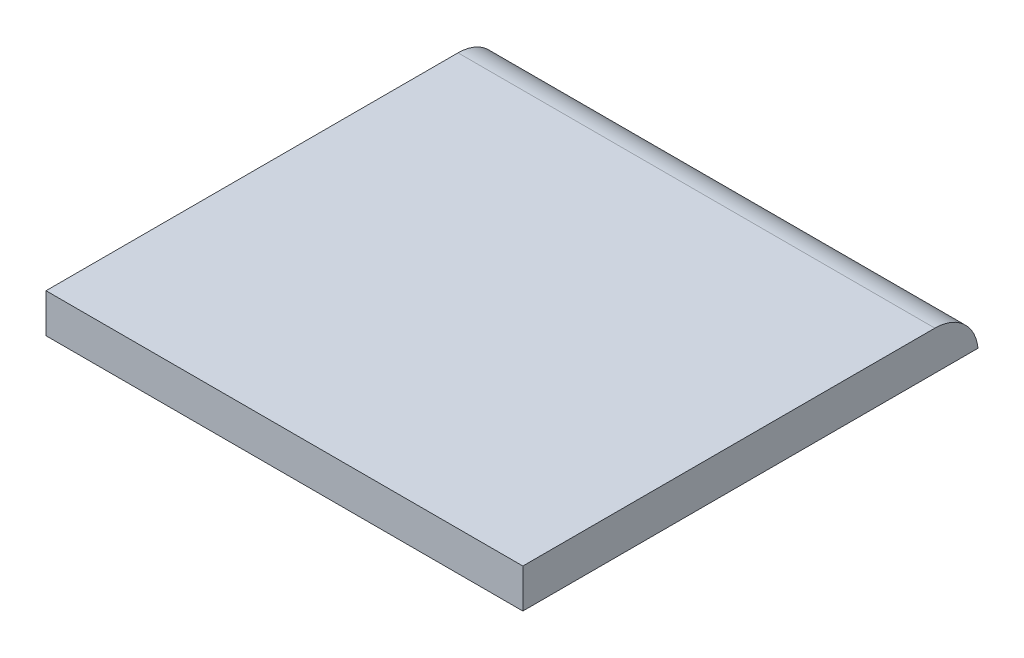
ISO-10303-21;
HEADER;
FILE_DESCRIPTION(('STEP AP214'),'2;1');
FILE_NAME('part.step','',(''),(''),'','','');
FILE_SCHEMA(('AUTOMOTIVE_DESIGN { 1 0 10303 214 1 1 1 1 }'));
ENDSEC;
DATA;
#1=APPLICATION_CONTEXT('core data for automotive mechanical design processes');
#2=APPLICATION_PROTOCOL_DEFINITION('international standard','automotive_design',2000,#1);
#3=PRODUCT_CONTEXT('',#1,'mechanical');
#4=PRODUCT('Part','Part','',(#3));
#5=PRODUCT_RELATED_PRODUCT_CATEGORY('part','',(#4));
#6=PRODUCT_DEFINITION_FORMATION('','',#4);
#7=PRODUCT_DEFINITION_CONTEXT('part definition',#1,'design');
#8=PRODUCT_DEFINITION('design','',#6,#7);
#9=PRODUCT_DEFINITION_SHAPE('','',#8);
#10=(LENGTH_UNIT() NAMED_UNIT(*) SI_UNIT(.MILLI.,.METRE.));
#11=(NAMED_UNIT(*) PLANE_ANGLE_UNIT() SI_UNIT($,.RADIAN.));
#12=(NAMED_UNIT(*) SI_UNIT($,.STERADIAN.) SOLID_ANGLE_UNIT());
#13=UNCERTAINTY_MEASURE_WITH_UNIT(LENGTH_MEASURE(1.E-05),#10,'distance_accuracy_value','');
#14=(GEOMETRIC_REPRESENTATION_CONTEXT(3) GLOBAL_UNCERTAINTY_ASSIGNED_CONTEXT((#13)) GLOBAL_UNIT_ASSIGNED_CONTEXT((#10,
#11,#12)) REPRESENTATION_CONTEXT('',''));
#15=CARTESIAN_POINT('',(0.,0.,0.));
#16=DIRECTION('',(0.,0.,1.));
#17=DIRECTION('',(1.,0.,0.));
#18=AXIS2_PLACEMENT_3D('',#15,#16,#17);
#19=CARTESIAN_POINT('',(110.,0.,0.));
#20=DIRECTION('',(0.,0.,-1.));
#21=DIRECTION('',(0.,1.,0.));
#22=AXIS2_PLACEMENT_3D('',#19,#20,#21);
#23=PLANE('',#22);
#24=DIRECTION('',(0.,-1.,0.));
#25=VECTOR('',#24,1.);
#26=CARTESIAN_POINT('',(0.,0.,0.));
#27=LINE('',#26,#25);
#28=CARTESIAN_POINT('',(0.,8.99999999999999,0.));
#29=VERTEX_POINT('',#28);
#30=CARTESIAN_POINT('',(0.,0.,0.));
#31=VERTEX_POINT('',#30);
#32=EDGE_CURVE('E105',#29,#31,#27,.T.);
#33=ORIENTED_EDGE('',*,*,#32,.T.);
#34=DIRECTION('',(-1.,0.,0.));
#35=VECTOR('',#34,1.);
#36=CARTESIAN_POINT('',(110.,0.,0.));
#37=LINE('',#36,#35);
#38=CARTESIAN_POINT('',(110.,0.,0.));
#39=VERTEX_POINT('',#38);
#40=EDGE_CURVE('E91',#39,#31,#37,.T.);
#41=ORIENTED_EDGE('',*,*,#40,.F.);
#42=DIRECTION('',(0.,-1.,0.));
#43=VECTOR('',#42,1.);
#44=CARTESIAN_POINT('',(110.,0.,0.));
#45=LINE('',#44,#43);
#46=CARTESIAN_POINT('',(110.,8.99999999999999,0.));
#47=VERTEX_POINT('',#46);
#48=EDGE_CURVE('E95',#47,#39,#45,.T.);
#49=ORIENTED_EDGE('',*,*,#48,.F.);
#50=DIRECTION('',(-1.,0.,0.));
#51=VECTOR('',#50,1.);
#52=CARTESIAN_POINT('',(110.,8.99999999999999,0.));
#53=LINE('',#52,#51);
#54=EDGE_CURVE('E109',#47,#29,#53,.T.);
#55=ORIENTED_EDGE('',*,*,#54,.T.);
#56=EDGE_LOOP('',(#33,#41,#49,#55));
#57=FACE_BOUND('',#56,.T.);
#58=ADVANCED_FACE('F47',(#57),#23,.F.);
#59=CARTESIAN_POINT('',(110.,0.,0.));
#60=DIRECTION('',(0.,1.,0.));
#61=DIRECTION('',(0.,0.,1.));
#62=AXIS2_PLACEMENT_3D('',#59,#60,#61);
#63=PLANE('',#62);
#64=DIRECTION('',(0.,0.,-1.));
#65=VECTOR('',#64,1.);
#66=CARTESIAN_POINT('',(0.,0.,0.));
#67=LINE('',#66,#65);
#68=CARTESIAN_POINT('',(0.,0.,-105.));
#69=VERTEX_POINT('',#68);
#70=EDGE_CURVE('E115',#31,#69,#67,.T.);
#71=ORIENTED_EDGE('',*,*,#70,.T.);
#72=DIRECTION('',(-1.,0.,0.));
#73=VECTOR('',#72,1.);
#74=CARTESIAN_POINT('',(110.,0.,-105.));
#75=LINE('',#74,#73);
#76=CARTESIAN_POINT('',(110.,0.,-105.));
#77=VERTEX_POINT('',#76);
#78=EDGE_CURVE('E93',#77,#69,#75,.T.);
#79=ORIENTED_EDGE('',*,*,#78,.F.);
#80=DIRECTION('',(0.,0.,-1.));
#81=VECTOR('',#80,1.);
#82=CARTESIAN_POINT('',(110.,0.,0.));
#83=LINE('',#82,#81);
#84=EDGE_CURVE('E86',#39,#77,#83,.T.);
#85=ORIENTED_EDGE('',*,*,#84,.F.);
#86=ORIENTED_EDGE('',*,*,#40,.T.);
#87=EDGE_LOOP('',(#71,#79,#85,#86));
#88=FACE_BOUND('',#87,.T.);
#89=ADVANCED_FACE('F89',(#88),#63,.F.);
#90=CARTESIAN_POINT('',(110.,8.99999999999999,0.));
#91=DIRECTION('',(0.,-1.,0.));
#92=DIRECTION('',(0.,0.,-1.));
#93=AXIS2_PLACEMENT_3D('',#90,#91,#92);
#94=PLANE('',#93);
#95=DIRECTION('',(0.,0.,1.));
#96=VECTOR('',#95,1.);
#97=CARTESIAN_POINT('',(110.,8.99999999999999,0.));
#98=LINE('',#97,#96);
#99=CARTESIAN_POINT('',(110.,8.99999999999999,-95.0501256289338));
#100=VERTEX_POINT('',#99);
#101=EDGE_CURVE('E94',#100,#47,#98,.T.);
#102=ORIENTED_EDGE('',*,*,#101,.F.);
#103=DIRECTION('',(-1.,0.,0.));
#104=VECTOR('',#103,1.);
#105=CARTESIAN_POINT('',(110.,8.99999999999999,-95.0501256289338));
#106=LINE('',#105,#104);
#107=CARTESIAN_POINT('',(0.,8.99999999999999,-95.0501256289338));
#108=VERTEX_POINT('',#107);
#109=EDGE_CURVE('E106',#100,#108,#106,.T.);
#110=ORIENTED_EDGE('',*,*,#109,.T.);
#111=DIRECTION('',(0.,0.,1.));
#112=VECTOR('',#111,1.);
#113=CARTESIAN_POINT('',(0.,8.99999999999999,0.));
#114=LINE('',#113,#112);
#115=EDGE_CURVE('E102',#108,#29,#114,.T.);
#116=ORIENTED_EDGE('',*,*,#115,.T.);
#117=ORIENTED_EDGE('',*,*,#54,.F.);
#118=EDGE_LOOP('',(#102,#110,#116,#117));
#119=FACE_BOUND('',#118,.T.);
#120=ADVANCED_FACE('F118',(#119),#94,.F.);
#121=CARTESIAN_POINT('',(110.,0.,0.));
#122=DIRECTION('',(-1.,0.,0.));
#123=DIRECTION('',(0.,0.,1.));
#124=AXIS2_PLACEMENT_3D('',#121,#122,#123);
#125=PLANE('',#124);
#126=ORIENTED_EDGE('',*,*,#84,.T.);
#127=CARTESIAN_POINT('',(110.,-1.00000000000001,-95.0501256289338));
#128=DIRECTION('',(-1.,0.,0.));
#129=DIRECTION('',(0.,0.,1.));
#130=AXIS2_PLACEMENT_3D('',#127,#128,#129);
#131=CIRCLE('',#130,10.);
#132=EDGE_CURVE('E13',#77,#100,#131,.F.);
#133=ORIENTED_EDGE('',*,*,#132,.T.);
#134=ORIENTED_EDGE('',*,*,#101,.T.);
#135=ORIENTED_EDGE('',*,*,#48,.T.);
#136=EDGE_LOOP('',(#126,#133,#134,#135));
#137=FACE_BOUND('',#136,.T.);
#138=ADVANCED_FACE('F98',(#137),#125,.F.);
#139=CARTESIAN_POINT('',(0.,0.,0.));
#140=DIRECTION('',(-1.,0.,0.));
#141=DIRECTION('',(0.,0.,1.));
#142=AXIS2_PLACEMENT_3D('',#139,#140,#141);
#143=PLANE('',#142);
#144=ORIENTED_EDGE('',*,*,#115,.F.);
#145=CARTESIAN_POINT('',(0.,-1.00000000000001,-95.0501256289338));
#146=DIRECTION('',(-1.,0.,0.));
#147=DIRECTION('',(0.,0.,1.));
#148=AXIS2_PLACEMENT_3D('',#145,#146,#147);
#149=CIRCLE('',#148,10.);
#150=EDGE_CURVE('E55',#108,#69,#149,.T.);
#151=ORIENTED_EDGE('',*,*,#150,.T.);
#152=ORIENTED_EDGE('',*,*,#70,.F.);
#153=ORIENTED_EDGE('',*,*,#32,.F.);
#154=EDGE_LOOP('',(#144,#151,#152,#153));
#155=FACE_BOUND('',#154,.T.);
#156=ADVANCED_FACE('F114',(#155),#143,.T.);
#157=CARTESIAN_POINT('',(110.,-1.00000000000001,-95.0501256289338));
#158=DIRECTION('',(-1.,0.,0.));
#159=DIRECTION('',(0.,0.,1.));
#160=AXIS2_PLACEMENT_3D('',#157,#158,#159);
#161=CYLINDRICAL_SURFACE('',#160,10.);
#162=ORIENTED_EDGE('',*,*,#132,.F.);
#163=ORIENTED_EDGE('',*,*,#78,.T.);
#164=ORIENTED_EDGE('',*,*,#150,.F.);
#165=ORIENTED_EDGE('',*,*,#109,.F.);
#166=EDGE_LOOP('',(#162,#163,#164,#165));
#167=FACE_BOUND('',#166,.T.);
#168=ADVANCED_FACE('F49',(#167),#161,.T.);
#169=CLOSED_SHELL('',(#58,#89,#120,#138,#156,#168));
#170=MANIFOLD_SOLID_BREP('B2',#169);
#171=ADVANCED_BREP_SHAPE_REPRESENTATION('',(#18,#170),#14);
#172=SHAPE_DEFINITION_REPRESENTATION(#9,#171);
ENDSEC;
END-ISO-10303-21;
